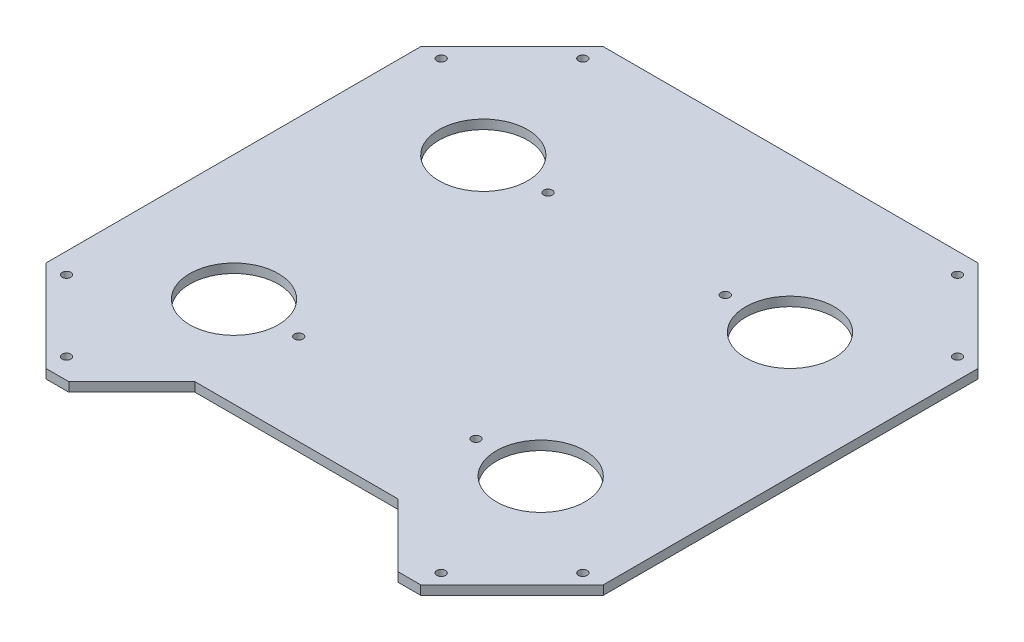
ISO-10303-21;
HEADER;
FILE_DESCRIPTION(('STEP AP214'),'2;1');
FILE_NAME('part.step','',(''),(''),'','','');
FILE_SCHEMA(('AUTOMOTIVE_DESIGN { 1 0 10303 214 1 1 1 1 }'));
ENDSEC;
DATA;
#1=APPLICATION_CONTEXT('core data for automotive mechanical design processes');
#2=APPLICATION_PROTOCOL_DEFINITION('international standard','automotive_design',2000,#1);
#3=PRODUCT_CONTEXT('',#1,'mechanical');
#4=PRODUCT('Part','Part','',(#3));
#5=PRODUCT_RELATED_PRODUCT_CATEGORY('part','',(#4));
#6=PRODUCT_DEFINITION_FORMATION('','',#4);
#7=PRODUCT_DEFINITION_CONTEXT('part definition',#1,'design');
#8=PRODUCT_DEFINITION('design','',#6,#7);
#9=PRODUCT_DEFINITION_SHAPE('','',#8);
#10=(LENGTH_UNIT() NAMED_UNIT(*) SI_UNIT(.MILLI.,.METRE.));
#11=(NAMED_UNIT(*) PLANE_ANGLE_UNIT() SI_UNIT($,.RADIAN.));
#12=(NAMED_UNIT(*) SI_UNIT($,.STERADIAN.) SOLID_ANGLE_UNIT());
#13=UNCERTAINTY_MEASURE_WITH_UNIT(LENGTH_MEASURE(1.E-05),#10,'distance_accuracy_value','');
#14=(GEOMETRIC_REPRESENTATION_CONTEXT(3) GLOBAL_UNCERTAINTY_ASSIGNED_CONTEXT((#13)) GLOBAL_UNIT_ASSIGNED_CONTEXT((#10,
#11,#12)) REPRESENTATION_CONTEXT('',''));
#15=CARTESIAN_POINT('',(0.,0.,0.));
#16=DIRECTION('',(0.,0.,1.));
#17=DIRECTION('',(1.,0.,0.));
#18=AXIS2_PLACEMENT_3D('',#15,#16,#17);
#19=CARTESIAN_POINT('',(0.,0.,0.));
#20=DIRECTION('',(0.,1.,0.));
#21=DIRECTION('',(0.,0.,1.));
#22=AXIS2_PLACEMENT_3D('',#19,#20,#21);
#23=PLANE('',#22);
#24=CARTESIAN_POINT('',(-204.999999999999,0.,-22.4577113704848));
#25=DIRECTION('',(0.,1.,0.));
#26=DIRECTION('',(0.,0.,1.));
#27=AXIS2_PLACEMENT_3D('',#24,#25,#26);
#28=CIRCLE('',#27,4.76250000000001);
#29=CARTESIAN_POINT('',(-204.999999999999,0.,-17.6952113704848));
#30=VERTEX_POINT('',#29);
#31=EDGE_CURVE('E417',#30,#30,#28,.T.);
#32=ORIENTED_EDGE('',*,*,#31,.T.);
#33=EDGE_LOOP('',(#32));
#34=FACE_BOUND('',#33,.T.);
#35=CARTESIAN_POINT('',(282.542288629515,0.,-509.999999999999));
#36=DIRECTION('',(0.,1.,0.));
#37=DIRECTION('',(0.,0.,1.));
#38=AXIS2_PLACEMENT_3D('',#35,#36,#37);
#39=CIRCLE('',#38,4.76250000000003);
#40=CARTESIAN_POINT('',(282.542288629515,0.,-505.237499999999));
#41=VERTEX_POINT('',#40);
#42=EDGE_CURVE('E426',#41,#41,#39,.T.);
#43=ORIENTED_EDGE('',*,*,#42,.T.);
#44=EDGE_LOOP('',(#43));
#45=FACE_BOUND('',#44,.T.);
#46=CARTESIAN_POINT('',(204.999999999999,0.,-587.542288629515));
#47=DIRECTION('',(0.,1.,0.));
#48=DIRECTION('',(0.,0.,1.));
#49=AXIS2_PLACEMENT_3D('',#46,#47,#48);
#50=CIRCLE('',#49,4.76250000000003);
#51=CARTESIAN_POINT('',(204.999999999999,0.,-582.779788629515));
#52=VERTEX_POINT('',#51);
#53=EDGE_CURVE('E429',#52,#52,#50,.T.);
#54=ORIENTED_EDGE('',*,*,#53,.T.);
#55=EDGE_LOOP('',(#54));
#56=FACE_BOUND('',#55,.T.);
#57=CARTESIAN_POINT('',(-282.542288629515,0.,-100.000000000001));
#58=DIRECTION('',(0.,1.,0.));
#59=DIRECTION('',(0.,0.,1.));
#60=AXIS2_PLACEMENT_3D('',#57,#58,#59);
#61=CIRCLE('',#60,4.76250000000001);
#62=CARTESIAN_POINT('',(-282.542288629515,0.,-95.237500000001));
#63=VERTEX_POINT('',#62);
#64=EDGE_CURVE('E438',#63,#63,#61,.T.);
#65=ORIENTED_EDGE('',*,*,#64,.T.);
#66=EDGE_LOOP('',(#65));
#67=FACE_BOUND('',#66,.T.);
#68=DIRECTION('',(1.,0.,0.));
#69=VECTOR('',#68,1.);
#70=CARTESIAN_POINT('',(0.,0.,0.));
#71=LINE('',#70,#69);
#72=CARTESIAN_POINT('',(180.,0.,0.));
#73=VERTEX_POINT('',#72);
#74=CARTESIAN_POINT('',(205.,0.,0.));
#75=VERTEX_POINT('',#74);
#76=EDGE_CURVE('E303',#73,#75,#71,.T.);
#77=ORIENTED_EDGE('',*,*,#76,.F.);
#78=DIRECTION('',(-0.707106781186551,0.,-0.707106781186544));
#79=VECTOR('',#78,1.);
#80=CARTESIAN_POINT('',(89.9999999999989,0.,-89.9999999999999));
#81=LINE('',#80,#79);
#82=CARTESIAN_POINT('',(110.999999999999,0.,-69.0000000000001));
#83=VERTEX_POINT('',#82);
#84=EDGE_CURVE('E295',#73,#83,#81,.T.);
#85=ORIENTED_EDGE('',*,*,#84,.T.);
#86=DIRECTION('',(-1.,0.,0.));
#87=VECTOR('',#86,1.);
#88=CARTESIAN_POINT('',(0.,0.,-69.0000000000001));
#89=LINE('',#88,#87);
#90=CARTESIAN_POINT('',(-111.,0.,-69.));
#91=VERTEX_POINT('',#90);
#92=EDGE_CURVE('E364',#83,#91,#89,.T.);
#93=ORIENTED_EDGE('',*,*,#92,.T.);
#94=DIRECTION('',(0.707106781186546,0.,-0.707106781186549));
#95=VECTOR('',#94,1.);
#96=CARTESIAN_POINT('',(-90.0000000000003,0.,-89.9999999999999));
#97=LINE('',#96,#95);
#98=CARTESIAN_POINT('',(-180.,0.,0.));
#99=VERTEX_POINT('',#98);
#100=EDGE_CURVE('E360',#99,#91,#97,.T.);
#101=ORIENTED_EDGE('',*,*,#100,.F.);
#102=CARTESIAN_POINT('',(-205.,0.,0.));
#103=VERTEX_POINT('',#102);
#104=EDGE_CURVE('E304',#103,#99,#71,.T.);
#105=ORIENTED_EDGE('',*,*,#104,.F.);
#106=DIRECTION('',(0.707106781186545,0.,0.707106781186551));
#107=VECTOR('',#106,1.);
#108=CARTESIAN_POINT('',(-102.500000000001,0.,102.5));
#109=LINE('',#108,#107);
#110=CARTESIAN_POINT('',(-305.,0.,-100.000000000001));
#111=VERTEX_POINT('',#110);
#112=EDGE_CURVE('E300',#111,#103,#109,.T.);
#113=ORIENTED_EDGE('',*,*,#112,.F.);
#114=DIRECTION('',(0.,0.,1.));
#115=VECTOR('',#114,1.);
#116=CARTESIAN_POINT('',(-305.,0.,0.));
#117=LINE('',#116,#115);
#118=CARTESIAN_POINT('',(-305.,0.,-509.999999999999));
#119=VERTEX_POINT('',#118);
#120=EDGE_CURVE('E298',#119,#111,#117,.T.);
#121=ORIENTED_EDGE('',*,*,#120,.F.);
#122=DIRECTION('',(0.707106781186542,0.,-0.707106781186553));
#123=VECTOR('',#122,1.);
#124=CARTESIAN_POINT('',(-407.500000000002,0.,-407.499999999996));
#125=LINE('',#124,#123);
#126=CARTESIAN_POINT('',(-205.,0.,-610.));
#127=VERTEX_POINT('',#126);
#128=EDGE_CURVE('E315',#119,#127,#125,.T.);
#129=ORIENTED_EDGE('',*,*,#128,.T.);
#130=DIRECTION('',(-1.,0.,0.));
#131=VECTOR('',#130,1.);
#132=CARTESIAN_POINT('',(0.,0.,-610.));
#133=LINE('',#132,#131);
#134=CARTESIAN_POINT('',(205.,0.,-610.));
#135=VERTEX_POINT('',#134);
#136=EDGE_CURVE('E313',#135,#127,#133,.T.);
#137=ORIENTED_EDGE('',*,*,#136,.F.);
#138=DIRECTION('',(-0.707106781186544,0.,-0.707106781186551));
#139=VECTOR('',#138,1.);
#140=CARTESIAN_POINT('',(407.500000000001,0.,-407.499999999997));
#141=LINE('',#140,#139);
#142=CARTESIAN_POINT('',(305.,0.,-509.999999999999));
#143=VERTEX_POINT('',#142);
#144=EDGE_CURVE('E260',#143,#135,#141,.T.);
#145=ORIENTED_EDGE('',*,*,#144,.F.);
#146=DIRECTION('',(0.,0.,-1.));
#147=VECTOR('',#146,1.);
#148=CARTESIAN_POINT('',(305.,0.,0.));
#149=LINE('',#148,#147);
#150=CARTESIAN_POINT('',(305.,0.,-100.000000000001));
#151=VERTEX_POINT('',#150);
#152=EDGE_CURVE('E310',#151,#143,#149,.T.);
#153=ORIENTED_EDGE('',*,*,#152,.F.);
#154=DIRECTION('',(-0.707106781186545,0.,0.707106781186551));
#155=VECTOR('',#154,1.);
#156=CARTESIAN_POINT('',(102.500000000001,0.,102.5));
#157=LINE('',#156,#155);
#158=EDGE_CURVE('E307',#151,#75,#157,.T.);
#159=ORIENTED_EDGE('',*,*,#158,.T.);
#160=EDGE_LOOP('',(#77,#85,#93,#101,#105,#113,#121,#129,#137,#145,#153,#159));
#161=FACE_BOUND('',#160,.T.);
#162=CARTESIAN_POINT('',(-167.821284449809,0.,-168.589357775095));
#163=DIRECTION('',(0.,1.,0.));
#164=DIRECTION('',(0.,0.,1.));
#165=AXIS2_PLACEMENT_3D('',#162,#163,#164);
#166=CIRCLE('',#165,48.5);
#167=CARTESIAN_POINT('',(-167.821284449809,0.,-120.089357775095));
#168=VERTEX_POINT('',#167);
#169=EDGE_CURVE('E318',#168,#168,#166,.F.);
#170=ORIENTED_EDGE('',*,*,#169,.F.);
#171=EDGE_LOOP('',(#170));
#172=FACE_BOUND('',#171,.T.);
#173=CARTESIAN_POINT('',(-167.821284449809,0.,-441.410642224905));
#174=DIRECTION('',(0.,1.,0.));
#175=DIRECTION('',(0.,0.,1.));
#176=AXIS2_PLACEMENT_3D('',#173,#174,#175);
#177=CIRCLE('',#176,48.4999999999998);
#178=CARTESIAN_POINT('',(-167.821284449809,0.,-392.910642224905));
#179=VERTEX_POINT('',#178);
#180=EDGE_CURVE('E321',#179,#179,#177,.T.);
#181=ORIENTED_EDGE('',*,*,#180,.T.);
#182=EDGE_LOOP('',(#181));
#183=FACE_BOUND('',#182,.T.);
#184=CARTESIAN_POINT('',(-97.,0.,-441.410642224905));
#185=DIRECTION('',(0.,1.,0.));
#186=DIRECTION('',(0.,0.,1.));
#187=AXIS2_PLACEMENT_3D('',#184,#185,#186);
#188=CIRCLE('',#187,4.7625);
#189=CARTESIAN_POINT('',(-97.,0.,-436.648142224905));
#190=VERTEX_POINT('',#189);
#191=EDGE_CURVE('E324',#190,#190,#188,.T.);
#192=ORIENTED_EDGE('',*,*,#191,.T.);
#193=EDGE_LOOP('',(#192));
#194=FACE_BOUND('',#193,.T.);
#195=CARTESIAN_POINT('',(-96.9999999999998,0.,-168.589357775095));
#196=DIRECTION('',(0.,1.,0.));
#197=DIRECTION('',(0.,0.,1.));
#198=AXIS2_PLACEMENT_3D('',#195,#196,#197);
#199=CIRCLE('',#198,4.7625);
#200=CARTESIAN_POINT('',(-96.9999999999998,0.,-163.826857775095));
#201=VERTEX_POINT('',#200);
#202=EDGE_CURVE('E327',#201,#201,#199,.F.);
#203=ORIENTED_EDGE('',*,*,#202,.F.);
#204=EDGE_LOOP('',(#203));
#205=FACE_BOUND('',#204,.T.);
#206=CARTESIAN_POINT('',(97.,0.,-441.410642224905));
#207=DIRECTION('',(0.,1.,0.));
#208=DIRECTION('',(0.,0.,1.));
#209=AXIS2_PLACEMENT_3D('',#206,#207,#208);
#210=CIRCLE('',#209,4.7625);
#211=CARTESIAN_POINT('',(97.,0.,-436.648142224905));
#212=VERTEX_POINT('',#211);
#213=EDGE_CURVE('E333',#212,#212,#210,.F.);
#214=ORIENTED_EDGE('',*,*,#213,.F.);
#215=EDGE_LOOP('',(#214));
#216=FACE_BOUND('',#215,.T.);
#217=CARTESIAN_POINT('',(97.0000000000002,0.,-168.589357775095));
#218=DIRECTION('',(0.,1.,0.));
#219=DIRECTION('',(0.,0.,1.));
#220=AXIS2_PLACEMENT_3D('',#217,#218,#219);
#221=CIRCLE('',#220,4.7625);
#222=CARTESIAN_POINT('',(97.0000000000002,0.,-163.826857775095));
#223=VERTEX_POINT('',#222);
#224=EDGE_CURVE('E330',#223,#223,#221,.T.);
#225=ORIENTED_EDGE('',*,*,#224,.T.);
#226=EDGE_LOOP('',(#225));
#227=FACE_BOUND('',#226,.T.);
#228=CARTESIAN_POINT('',(167.821284449809,0.,-168.589357775095));
#229=DIRECTION('',(0.,1.,0.));
#230=DIRECTION('',(0.,0.,1.));
#231=AXIS2_PLACEMENT_3D('',#228,#229,#230);
#232=CIRCLE('',#231,48.5);
#233=CARTESIAN_POINT('',(167.821284449809,0.,-120.089357775095));
#234=VERTEX_POINT('',#233);
#235=EDGE_CURVE('E294',#234,#234,#232,.T.);
#236=ORIENTED_EDGE('',*,*,#235,.T.);
#237=EDGE_LOOP('',(#236));
#238=FACE_BOUND('',#237,.T.);
#239=CARTESIAN_POINT('',(167.82128444981,0.,-441.410642224905));
#240=DIRECTION('',(0.,1.,0.));
#241=DIRECTION('',(0.,0.,1.));
#242=AXIS2_PLACEMENT_3D('',#239,#240,#241);
#243=CIRCLE('',#242,48.5);
#244=CARTESIAN_POINT('',(167.82128444981,0.,-392.910642224905));
#245=VERTEX_POINT('',#244);
#246=EDGE_CURVE('E291',#245,#245,#243,.F.);
#247=ORIENTED_EDGE('',*,*,#246,.F.);
#248=EDGE_LOOP('',(#247));
#249=FACE_BOUND('',#248,.T.);
#250=CARTESIAN_POINT('',(-282.542288629515,0.,-509.999999999999));
#251=DIRECTION('',(0.,1.,0.));
#252=DIRECTION('',(0.,0.,1.));
#253=AXIS2_PLACEMENT_3D('',#250,#251,#252);
#254=CIRCLE('',#253,4.76250000000003);
#255=CARTESIAN_POINT('',(-282.542288629515,0.,-505.237499999999));
#256=VERTEX_POINT('',#255);
#257=EDGE_CURVE('E435',#256,#256,#254,.F.);
#258=ORIENTED_EDGE('',*,*,#257,.F.);
#259=EDGE_LOOP('',(#258));
#260=FACE_BOUND('',#259,.T.);
#261=CARTESIAN_POINT('',(-204.999999999999,0.,-587.542288629515));
#262=DIRECTION('',(0.,1.,0.));
#263=DIRECTION('',(0.,0.,1.));
#264=AXIS2_PLACEMENT_3D('',#261,#262,#263);
#265=CIRCLE('',#264,4.76250000000003);
#266=CARTESIAN_POINT('',(-204.999999999999,0.,-582.779788629515));
#267=VERTEX_POINT('',#266);
#268=EDGE_CURVE('E432',#267,#267,#265,.F.);
#269=ORIENTED_EDGE('',*,*,#268,.F.);
#270=EDGE_LOOP('',(#269));
#271=FACE_BOUND('',#270,.T.);
#272=CARTESIAN_POINT('',(282.542288629515,0.,-100.000000000001));
#273=DIRECTION('',(0.,1.,0.));
#274=DIRECTION('',(0.,0.,1.));
#275=AXIS2_PLACEMENT_3D('',#272,#273,#274);
#276=CIRCLE('',#275,4.76250000000001);
#277=CARTESIAN_POINT('',(282.542288629515,0.,-95.237500000001));
#278=VERTEX_POINT('',#277);
#279=EDGE_CURVE('E423',#278,#278,#276,.F.);
#280=ORIENTED_EDGE('',*,*,#279,.F.);
#281=EDGE_LOOP('',(#280));
#282=FACE_BOUND('',#281,.T.);
#283=CARTESIAN_POINT('',(204.999999999999,0.,-22.4577113704848));
#284=DIRECTION('',(0.,1.,0.));
#285=DIRECTION('',(0.,0.,1.));
#286=AXIS2_PLACEMENT_3D('',#283,#284,#285);
#287=CIRCLE('',#286,4.76250000000001);
#288=CARTESIAN_POINT('',(204.999999999999,0.,-17.6952113704848));
#289=VERTEX_POINT('',#288);
#290=EDGE_CURVE('E420',#289,#289,#287,.F.);
#291=ORIENTED_EDGE('',*,*,#290,.F.);
#292=EDGE_LOOP('',(#291));
#293=FACE_BOUND('',#292,.T.);
#294=ADVANCED_FACE('F161',(#34,#45,#56,#67,#161,#172,#183,#194,#205,#216,#227,#238,#249,#260,
#271,#282,#293),#23,.F.);
#295=CARTESIAN_POINT('',(0.,10.,0.));
#296=DIRECTION('',(0.,1.,0.));
#297=DIRECTION('',(0.,0.,1.));
#298=AXIS2_PLACEMENT_3D('',#295,#296,#297);
#299=PLANE('',#298);
#300=CARTESIAN_POINT('',(-204.999999999999,10.,-22.4577113704848));
#301=DIRECTION('',(0.,1.,0.));
#302=DIRECTION('',(0.,0.,1.));
#303=AXIS2_PLACEMENT_3D('',#300,#301,#302);
#304=CIRCLE('',#303,4.76250000000001);
#305=CARTESIAN_POINT('',(-204.999999999999,10.,-17.6952113704848));
#306=VERTEX_POINT('',#305);
#307=EDGE_CURVE('E444',#306,#306,#304,.T.);
#308=ORIENTED_EDGE('',*,*,#307,.F.);
#309=EDGE_LOOP('',(#308));
#310=FACE_BOUND('',#309,.T.);
#311=CARTESIAN_POINT('',(282.542288629515,10.,-100.000000000001));
#312=DIRECTION('',(0.,-1.,0.));
#313=DIRECTION('',(0.,0.,-1.));
#314=AXIS2_PLACEMENT_3D('',#311,#312,#313);
#315=CIRCLE('',#314,4.76250000000001);
#316=CARTESIAN_POINT('',(282.542288629515,10.,-104.762500000001));
#317=VERTEX_POINT('',#316);
#318=EDGE_CURVE('E448',#317,#317,#315,.T.);
#319=ORIENTED_EDGE('',*,*,#318,.T.);
#320=EDGE_LOOP('',(#319));
#321=FACE_BOUND('',#320,.T.);
#322=CARTESIAN_POINT('',(282.542288629515,10.,-509.999999999999));
#323=DIRECTION('',(0.,1.,0.));
#324=DIRECTION('',(0.,0.,1.));
#325=AXIS2_PLACEMENT_3D('',#322,#323,#324);
#326=CIRCLE('',#325,4.76250000000003);
#327=CARTESIAN_POINT('',(282.542288629515,10.,-505.237499999999));
#328=VERTEX_POINT('',#327);
#329=EDGE_CURVE('E445',#328,#328,#326,.T.);
#330=ORIENTED_EDGE('',*,*,#329,.F.);
#331=EDGE_LOOP('',(#330));
#332=FACE_BOUND('',#331,.T.);
#333=CARTESIAN_POINT('',(204.999999999999,10.,-587.542288629515));
#334=DIRECTION('',(0.,1.,0.));
#335=DIRECTION('',(0.,0.,1.));
#336=AXIS2_PLACEMENT_3D('',#333,#334,#335);
#337=CIRCLE('',#336,4.76250000000003);
#338=CARTESIAN_POINT('',(204.999999999999,10.,-582.779788629515));
#339=VERTEX_POINT('',#338);
#340=EDGE_CURVE('E449',#339,#339,#337,.T.);
#341=ORIENTED_EDGE('',*,*,#340,.F.);
#342=EDGE_LOOP('',(#341));
#343=FACE_BOUND('',#342,.T.);
#344=CARTESIAN_POINT('',(-282.542288629515,10.,-509.999999999999));
#345=DIRECTION('',(0.,-1.,0.));
#346=DIRECTION('',(0.,0.,-1.));
#347=AXIS2_PLACEMENT_3D('',#344,#345,#346);
#348=CIRCLE('',#347,4.76250000000003);
#349=CARTESIAN_POINT('',(-282.542288629515,10.,-514.762499999999));
#350=VERTEX_POINT('',#349);
#351=EDGE_CURVE('E457',#350,#350,#348,.T.);
#352=ORIENTED_EDGE('',*,*,#351,.T.);
#353=EDGE_LOOP('',(#352));
#354=FACE_BOUND('',#353,.T.);
#355=CARTESIAN_POINT('',(-282.542288629515,10.,-100.000000000001));
#356=DIRECTION('',(0.,1.,0.));
#357=DIRECTION('',(0.,0.,1.));
#358=AXIS2_PLACEMENT_3D('',#355,#356,#357);
#359=CIRCLE('',#358,4.76250000000001);
#360=CARTESIAN_POINT('',(-282.542288629515,10.,-95.237500000001));
#361=VERTEX_POINT('',#360);
#362=EDGE_CURVE('E441',#361,#361,#359,.T.);
#363=ORIENTED_EDGE('',*,*,#362,.F.);
#364=EDGE_LOOP('',(#363));
#365=FACE_BOUND('',#364,.T.);
#366=DIRECTION('',(-0.707106781186551,0.,-0.707106781186544));
#367=VECTOR('',#366,1.);
#368=CARTESIAN_POINT('',(89.9999999999989,10.,-89.9999999999999));
#369=LINE('',#368,#367);
#370=CARTESIAN_POINT('',(180.,10.,0.));
#371=VERTEX_POINT('',#370);
#372=CARTESIAN_POINT('',(110.999999999999,10.,-69.0000000000001));
#373=VERTEX_POINT('',#372);
#374=EDGE_CURVE('E176',#371,#373,#369,.T.);
#375=ORIENTED_EDGE('',*,*,#374,.F.);
#376=DIRECTION('',(1.,0.,0.));
#377=VECTOR('',#376,1.);
#378=CARTESIAN_POINT('',(0.,10.,0.));
#379=LINE('',#378,#377);
#380=CARTESIAN_POINT('',(205.,10.,0.));
#381=VERTEX_POINT('',#380);
#382=EDGE_CURVE('E383',#371,#381,#379,.T.);
#383=ORIENTED_EDGE('',*,*,#382,.T.);
#384=DIRECTION('',(-0.707106781186545,0.,0.707106781186551));
#385=VECTOR('',#384,1.);
#386=CARTESIAN_POINT('',(102.500000000001,10.,102.5));
#387=LINE('',#386,#385);
#388=CARTESIAN_POINT('',(305.,10.,-100.000000000001));
#389=VERTEX_POINT('',#388);
#390=EDGE_CURVE('E385',#389,#381,#387,.T.);
#391=ORIENTED_EDGE('',*,*,#390,.F.);
#392=DIRECTION('',(0.,0.,-1.));
#393=VECTOR('',#392,1.);
#394=CARTESIAN_POINT('',(305.,10.,0.));
#395=LINE('',#394,#393);
#396=CARTESIAN_POINT('',(305.,10.,-509.999999999999));
#397=VERTEX_POINT('',#396);
#398=EDGE_CURVE('E251',#389,#397,#395,.T.);
#399=ORIENTED_EDGE('',*,*,#398,.T.);
#400=DIRECTION('',(-0.707106781186544,0.,-0.707106781186551));
#401=VECTOR('',#400,1.);
#402=CARTESIAN_POINT('',(407.500000000001,10.,-407.499999999997));
#403=LINE('',#402,#401);
#404=CARTESIAN_POINT('',(205.,10.,-610.));
#405=VERTEX_POINT('',#404);
#406=EDGE_CURVE('E241',#397,#405,#403,.T.);
#407=ORIENTED_EDGE('',*,*,#406,.T.);
#408=DIRECTION('',(-1.,0.,0.));
#409=VECTOR('',#408,1.);
#410=CARTESIAN_POINT('',(0.,10.,-610.));
#411=LINE('',#410,#409);
#412=CARTESIAN_POINT('',(-205.,10.,-610.));
#413=VERTEX_POINT('',#412);
#414=EDGE_CURVE('E247',#405,#413,#411,.T.);
#415=ORIENTED_EDGE('',*,*,#414,.T.);
#416=DIRECTION('',(0.707106781186542,0.,-0.707106781186553));
#417=VECTOR('',#416,1.);
#418=CARTESIAN_POINT('',(-407.500000000002,10.,-407.499999999996));
#419=LINE('',#418,#417);
#420=CARTESIAN_POINT('',(-305.,10.,-509.999999999999));
#421=VERTEX_POINT('',#420);
#422=EDGE_CURVE('E268',#421,#413,#419,.T.);
#423=ORIENTED_EDGE('',*,*,#422,.F.);
#424=DIRECTION('',(0.,0.,1.));
#425=VECTOR('',#424,1.);
#426=CARTESIAN_POINT('',(-305.,10.,0.));
#427=LINE('',#426,#425);
#428=CARTESIAN_POINT('',(-305.,10.,-100.000000000001));
#429=VERTEX_POINT('',#428);
#430=EDGE_CURVE('E380',#421,#429,#427,.T.);
#431=ORIENTED_EDGE('',*,*,#430,.T.);
#432=DIRECTION('',(0.707106781186545,0.,0.707106781186551));
#433=VECTOR('',#432,1.);
#434=CARTESIAN_POINT('',(-102.500000000001,10.,102.5));
#435=LINE('',#434,#433);
#436=CARTESIAN_POINT('',(-205.,10.,0.));
#437=VERTEX_POINT('',#436);
#438=EDGE_CURVE('E224',#429,#437,#435,.T.);
#439=ORIENTED_EDGE('',*,*,#438,.T.);
#440=CARTESIAN_POINT('',(-180.,10.,0.));
#441=VERTEX_POINT('',#440);
#442=EDGE_CURVE('E351',#437,#441,#379,.T.);
#443=ORIENTED_EDGE('',*,*,#442,.T.);
#444=DIRECTION('',(0.707106781186546,0.,-0.707106781186549));
#445=VECTOR('',#444,1.);
#446=CARTESIAN_POINT('',(-90.0000000000003,10.,-89.9999999999999));
#447=LINE('',#446,#445);
#448=CARTESIAN_POINT('',(-111.,10.,-69.));
#449=VERTEX_POINT('',#448);
#450=EDGE_CURVE('E406',#441,#449,#447,.T.);
#451=ORIENTED_EDGE('',*,*,#450,.T.);
#452=DIRECTION('',(-1.,0.,0.));
#453=VECTOR('',#452,1.);
#454=CARTESIAN_POINT('',(0.,10.,-69.0000000000001));
#455=LINE('',#454,#453);
#456=EDGE_CURVE('E410',#373,#449,#455,.T.);
#457=ORIENTED_EDGE('',*,*,#456,.F.);
#458=EDGE_LOOP('',(#375,#383,#391,#399,#407,#415,#423,#431,#439,#443,#451,#457));
#459=FACE_BOUND('',#458,.T.);
#460=CARTESIAN_POINT('',(-167.821284449809,10.,-168.589357775095));
#461=DIRECTION('',(0.,1.,0.));
#462=DIRECTION('',(0.,0.,1.));
#463=AXIS2_PLACEMENT_3D('',#460,#461,#462);
#464=CIRCLE('',#463,48.5);
#465=CARTESIAN_POINT('',(-167.821284449809,10.,-120.089357775095));
#466=VERTEX_POINT('',#465);
#467=EDGE_CURVE('E270',#466,#466,#464,.F.);
#468=ORIENTED_EDGE('',*,*,#467,.T.);
#469=EDGE_LOOP('',(#468));
#470=FACE_BOUND('',#469,.T.);
#471=CARTESIAN_POINT('',(-167.821284449809,10.,-441.410642224905));
#472=DIRECTION('',(0.,1.,0.));
#473=DIRECTION('',(0.,0.,1.));
#474=AXIS2_PLACEMENT_3D('',#471,#472,#473);
#475=CIRCLE('',#474,48.4999999999998);
#476=CARTESIAN_POINT('',(-167.821284449809,10.,-392.910642224905));
#477=VERTEX_POINT('',#476);
#478=EDGE_CURVE('E276',#477,#477,#475,.T.);
#479=ORIENTED_EDGE('',*,*,#478,.F.);
#480=EDGE_LOOP('',(#479));
#481=FACE_BOUND('',#480,.T.);
#482=CARTESIAN_POINT('',(-97.,10.,-441.410642224905));
#483=DIRECTION('',(0.,1.,0.));
#484=DIRECTION('',(0.,0.,1.));
#485=AXIS2_PLACEMENT_3D('',#482,#483,#484);
#486=CIRCLE('',#485,4.7625);
#487=CARTESIAN_POINT('',(-97.,10.,-436.648142224905));
#488=VERTEX_POINT('',#487);
#489=EDGE_CURVE('E279',#488,#488,#486,.T.);
#490=ORIENTED_EDGE('',*,*,#489,.F.);
#491=EDGE_LOOP('',(#490));
#492=FACE_BOUND('',#491,.T.);
#493=CARTESIAN_POINT('',(-96.9999999999998,10.,-168.589357775095));
#494=DIRECTION('',(0.,1.,0.));
#495=DIRECTION('',(0.,0.,1.));
#496=AXIS2_PLACEMENT_3D('',#493,#494,#495);
#497=CIRCLE('',#496,4.7625);
#498=CARTESIAN_POINT('',(-96.9999999999998,10.,-163.826857775095));
#499=VERTEX_POINT('',#498);
#500=EDGE_CURVE('E282',#499,#499,#497,.F.);
#501=ORIENTED_EDGE('',*,*,#500,.T.);
#502=EDGE_LOOP('',(#501));
#503=FACE_BOUND('',#502,.T.);
#504=CARTESIAN_POINT('',(97.,10.,-441.410642224905));
#505=DIRECTION('',(0.,1.,0.));
#506=DIRECTION('',(0.,0.,1.));
#507=AXIS2_PLACEMENT_3D('',#504,#505,#506);
#508=CIRCLE('',#507,4.7625);
#509=CARTESIAN_POINT('',(97.,10.,-436.648142224905));
#510=VERTEX_POINT('',#509);
#511=EDGE_CURVE('E288',#510,#510,#508,.F.);
#512=ORIENTED_EDGE('',*,*,#511,.T.);
#513=EDGE_LOOP('',(#512));
#514=FACE_BOUND('',#513,.T.);
#515=CARTESIAN_POINT('',(97.0000000000002,10.,-168.589357775095));
#516=DIRECTION('',(0.,1.,0.));
#517=DIRECTION('',(0.,0.,1.));
#518=AXIS2_PLACEMENT_3D('',#515,#516,#517);
#519=CIRCLE('',#518,4.7625);
#520=CARTESIAN_POINT('',(97.0000000000002,10.,-163.826857775095));
#521=VERTEX_POINT('',#520);
#522=EDGE_CURVE('E285',#521,#521,#519,.T.);
#523=ORIENTED_EDGE('',*,*,#522,.F.);
#524=EDGE_LOOP('',(#523));
#525=FACE_BOUND('',#524,.T.);
#526=CARTESIAN_POINT('',(167.821284449809,10.,-168.589357775095));
#527=DIRECTION('',(0.,1.,0.));
#528=DIRECTION('',(0.,0.,1.));
#529=AXIS2_PLACEMENT_3D('',#526,#527,#528);
#530=CIRCLE('',#529,48.5);
#531=CARTESIAN_POINT('',(167.821284449809,10.,-120.089357775095));
#532=VERTEX_POINT('',#531);
#533=EDGE_CURVE('E377',#532,#532,#530,.T.);
#534=ORIENTED_EDGE('',*,*,#533,.F.);
#535=EDGE_LOOP('',(#534));
#536=FACE_BOUND('',#535,.T.);
#537=CARTESIAN_POINT('',(167.82128444981,10.,-441.410642224905));
#538=DIRECTION('',(0.,1.,0.));
#539=DIRECTION('',(0.,0.,1.));
#540=AXIS2_PLACEMENT_3D('',#537,#538,#539);
#541=CIRCLE('',#540,48.5);
#542=CARTESIAN_POINT('',(167.82128444981,10.,-392.910642224905));
#543=VERTEX_POINT('',#542);
#544=EDGE_CURVE('E336',#543,#543,#541,.F.);
#545=ORIENTED_EDGE('',*,*,#544,.T.);
#546=EDGE_LOOP('',(#545));
#547=FACE_BOUND('',#546,.T.);
#548=CARTESIAN_POINT('',(-204.999999999999,10.,-587.542288629515));
#549=DIRECTION('',(0.,-1.,0.));
#550=DIRECTION('',(0.,0.,-1.));
#551=AXIS2_PLACEMENT_3D('',#548,#549,#550);
#552=CIRCLE('',#551,4.76250000000003);
#553=CARTESIAN_POINT('',(-204.999999999999,10.,-592.304788629515));
#554=VERTEX_POINT('',#553);
#555=EDGE_CURVE('E460',#554,#554,#552,.T.);
#556=ORIENTED_EDGE('',*,*,#555,.T.);
#557=EDGE_LOOP('',(#556));
#558=FACE_BOUND('',#557,.T.);
#559=CARTESIAN_POINT('',(204.999999999999,10.,-22.4577113704848));
#560=DIRECTION('',(0.,-1.,0.));
#561=DIRECTION('',(0.,0.,-1.));
#562=AXIS2_PLACEMENT_3D('',#559,#560,#561);
#563=CIRCLE('',#562,4.76250000000001);
#564=CARTESIAN_POINT('',(204.999999999999,10.,-27.2202113704848));
#565=VERTEX_POINT('',#564);
#566=EDGE_CURVE('E452',#565,#565,#563,.T.);
#567=ORIENTED_EDGE('',*,*,#566,.T.);
#568=EDGE_LOOP('',(#567));
#569=FACE_BOUND('',#568,.T.);
#570=ADVANCED_FACE('F243',(#310,#321,#332,#343,#354,#365,#459,#470,#481,#492,#503,#514,#525,
#536,#547,#558,#569),#299,.T.);
#571=CARTESIAN_POINT('',(0.,10.,0.));
#572=DIRECTION('',(0.,0.,-1.));
#573=DIRECTION('',(-1.,0.,0.));
#574=AXIS2_PLACEMENT_3D('',#571,#572,#573);
#575=PLANE('',#574);
#576=DIRECTION('',(0.,1.,0.));
#577=VECTOR('',#576,1.);
#578=CARTESIAN_POINT('',(-180.,-4990.,0.));
#579=LINE('',#578,#577);
#580=EDGE_CURVE('E407',#99,#441,#579,.T.);
#581=ORIENTED_EDGE('',*,*,#580,.T.);
#582=ORIENTED_EDGE('',*,*,#442,.F.);
#583=DIRECTION('',(0.,-1.,0.));
#584=VECTOR('',#583,1.);
#585=CARTESIAN_POINT('',(-205.,10.,0.));
#586=LINE('',#585,#584);
#587=EDGE_CURVE('E169',#437,#103,#586,.T.);
#588=ORIENTED_EDGE('',*,*,#587,.T.);
#589=ORIENTED_EDGE('',*,*,#104,.T.);
#590=EDGE_LOOP('',(#581,#582,#588,#589));
#591=FACE_BOUND('',#590,.T.);
#592=ADVANCED_FACE('F348',(#591),#575,.F.);
#593=CARTESIAN_POINT('',(0.,10.,-610.));
#594=DIRECTION('',(0.,0.,1.));
#595=DIRECTION('',(1.,0.,0.));
#596=AXIS2_PLACEMENT_3D('',#593,#594,#595);
#597=PLANE('',#596);
#598=DIRECTION('',(0.,-1.,0.));
#599=VECTOR('',#598,1.);
#600=CARTESIAN_POINT('',(-205.,10.,-610.));
#601=LINE('',#600,#599);
#602=EDGE_CURVE('E264',#413,#127,#601,.T.);
#603=ORIENTED_EDGE('',*,*,#602,.F.);
#604=ORIENTED_EDGE('',*,*,#414,.F.);
#605=DIRECTION('',(0.,-1.,0.));
#606=VECTOR('',#605,1.);
#607=CARTESIAN_POINT('',(205.,10.,-610.));
#608=LINE('',#607,#606);
#609=EDGE_CURVE('E257',#405,#135,#608,.T.);
#610=ORIENTED_EDGE('',*,*,#609,.T.);
#611=ORIENTED_EDGE('',*,*,#136,.T.);
#612=EDGE_LOOP('',(#603,#604,#610,#611));
#613=FACE_BOUND('',#612,.T.);
#614=ADVANCED_FACE('F266',(#613),#597,.F.);
#615=ORIENTED_EDGE('',*,*,#382,.F.);
#616=DIRECTION('',(0.,1.,0.));
#617=VECTOR('',#616,1.);
#618=CARTESIAN_POINT('',(180.,-4990.,0.));
#619=LINE('',#618,#617);
#620=EDGE_CURVE('E371',#73,#371,#619,.T.);
#621=ORIENTED_EDGE('',*,*,#620,.F.);
#622=ORIENTED_EDGE('',*,*,#76,.T.);
#623=DIRECTION('',(0.,-1.,0.));
#624=VECTOR('',#623,1.);
#625=CARTESIAN_POINT('',(205.,10.,0.));
#626=LINE('',#625,#624);
#627=EDGE_CURVE('E342',#381,#75,#626,.T.);
#628=ORIENTED_EDGE('',*,*,#627,.F.);
#629=EDGE_LOOP('',(#615,#621,#622,#628));
#630=FACE_BOUND('',#629,.T.);
#631=ADVANCED_FACE('F396',(#630),#575,.F.);
#632=CARTESIAN_POINT('',(102.500000000001,10.,102.5));
#633=DIRECTION('',(0.707106781186551,0.,0.707106781186545));
#634=DIRECTION('',(0.707106781186545,0.,-0.707106781186551));
#635=AXIS2_PLACEMENT_3D('',#632,#633,#634);
#636=PLANE('',#635);
#637=ORIENTED_EDGE('',*,*,#158,.F.);
#638=DIRECTION('',(0.,-1.,0.));
#639=VECTOR('',#638,1.);
#640=CARTESIAN_POINT('',(305.,10.,-100.000000000001));
#641=LINE('',#640,#639);
#642=EDGE_CURVE('E340',#389,#151,#641,.T.);
#643=ORIENTED_EDGE('',*,*,#642,.F.);
#644=ORIENTED_EDGE('',*,*,#390,.T.);
#645=ORIENTED_EDGE('',*,*,#627,.T.);
#646=EDGE_LOOP('',(#637,#643,#644,#645));
#647=FACE_BOUND('',#646,.T.);
#648=ADVANCED_FACE('F389',(#647),#636,.T.);
#649=CARTESIAN_POINT('',(305.,10.,0.));
#650=DIRECTION('',(-1.,0.,0.));
#651=DIRECTION('',(0.,0.,1.));
#652=AXIS2_PLACEMENT_3D('',#649,#650,#651);
#653=PLANE('',#652);
#654=ORIENTED_EDGE('',*,*,#152,.T.);
#655=DIRECTION('',(0.,-1.,0.));
#656=VECTOR('',#655,1.);
#657=CARTESIAN_POINT('',(305.,10.,-509.999999999999));
#658=LINE('',#657,#656);
#659=EDGE_CURVE('E263',#397,#143,#658,.T.);
#660=ORIENTED_EDGE('',*,*,#659,.F.);
#661=ORIENTED_EDGE('',*,*,#398,.F.);
#662=ORIENTED_EDGE('',*,*,#642,.T.);
#663=EDGE_LOOP('',(#654,#660,#661,#662));
#664=FACE_BOUND('',#663,.T.);
#665=ADVANCED_FACE('F527',(#664),#653,.F.);
#666=CARTESIAN_POINT('',(407.500000000001,10.,-407.499999999997));
#667=DIRECTION('',(-0.707106781186551,0.,0.707106781186544));
#668=DIRECTION('',(0.707106781186544,0.,0.707106781186551));
#669=AXIS2_PLACEMENT_3D('',#666,#667,#668);
#670=PLANE('',#669);
#671=ORIENTED_EDGE('',*,*,#144,.T.);
#672=ORIENTED_EDGE('',*,*,#609,.F.);
#673=ORIENTED_EDGE('',*,*,#406,.F.);
#674=ORIENTED_EDGE('',*,*,#659,.T.);
#675=EDGE_LOOP('',(#671,#672,#673,#674));
#676=FACE_BOUND('',#675,.T.);
#677=ADVANCED_FACE('F258',(#676),#670,.F.);
#678=CARTESIAN_POINT('',(167.82128444981,10.,-441.410642224905));
#679=DIRECTION('',(0.,-1.,0.));
#680=DIRECTION('',(0.,0.,-1.));
#681=AXIS2_PLACEMENT_3D('',#678,#679,#680);
#682=CYLINDRICAL_SURFACE('',#681,48.5);
#683=ORIENTED_EDGE('',*,*,#544,.F.);
#684=EDGE_LOOP('',(#683));
#685=FACE_BOUND('',#684,.T.);
#686=ORIENTED_EDGE('',*,*,#246,.T.);
#687=EDGE_LOOP('',(#686));
#688=FACE_BOUND('',#687,.T.);
#689=ADVANCED_FACE('F163',(#685,#688),#682,.F.);
#690=CARTESIAN_POINT('',(167.821284449809,10.,-168.589357775095));
#691=DIRECTION('',(0.,-1.,0.));
#692=DIRECTION('',(0.,0.,-1.));
#693=AXIS2_PLACEMENT_3D('',#690,#691,#692);
#694=CYLINDRICAL_SURFACE('',#693,48.5);
#695=ORIENTED_EDGE('',*,*,#533,.T.);
#696=EDGE_LOOP('',(#695));
#697=FACE_BOUND('',#696,.T.);
#698=ORIENTED_EDGE('',*,*,#235,.F.);
#699=EDGE_LOOP('',(#698));
#700=FACE_BOUND('',#699,.T.);
#701=ADVANCED_FACE('F502',(#697,#700),#694,.F.);
#702=CARTESIAN_POINT('',(97.0000000000002,10.,-168.589357775095));
#703=DIRECTION('',(0.,-1.,0.));
#704=DIRECTION('',(0.,0.,-1.));
#705=AXIS2_PLACEMENT_3D('',#702,#703,#704);
#706=CYLINDRICAL_SURFACE('',#705,4.7625);
#707=ORIENTED_EDGE('',*,*,#522,.T.);
#708=EDGE_LOOP('',(#707));
#709=FACE_BOUND('',#708,.T.);
#710=ORIENTED_EDGE('',*,*,#224,.F.);
#711=EDGE_LOOP('',(#710));
#712=FACE_BOUND('',#711,.T.);
#713=ADVANCED_FACE('F498',(#709,#712),#706,.F.);
#714=CARTESIAN_POINT('',(97.,10.,-441.410642224905));
#715=DIRECTION('',(0.,-1.,0.));
#716=DIRECTION('',(0.,0.,-1.));
#717=AXIS2_PLACEMENT_3D('',#714,#715,#716);
#718=CYLINDRICAL_SURFACE('',#717,4.7625);
#719=ORIENTED_EDGE('',*,*,#511,.F.);
#720=EDGE_LOOP('',(#719));
#721=FACE_BOUND('',#720,.T.);
#722=ORIENTED_EDGE('',*,*,#213,.T.);
#723=EDGE_LOOP('',(#722));
#724=FACE_BOUND('',#723,.T.);
#725=ADVANCED_FACE('F494',(#721,#724),#718,.F.);
#726=CARTESIAN_POINT('',(-96.9999999999998,10.,-168.589357775095));
#727=DIRECTION('',(0.,-1.,0.));
#728=DIRECTION('',(0.,0.,-1.));
#729=AXIS2_PLACEMENT_3D('',#726,#727,#728);
#730=CYLINDRICAL_SURFACE('',#729,4.7625);
#731=ORIENTED_EDGE('',*,*,#500,.F.);
#732=EDGE_LOOP('',(#731));
#733=FACE_BOUND('',#732,.T.);
#734=ORIENTED_EDGE('',*,*,#202,.T.);
#735=EDGE_LOOP('',(#734));
#736=FACE_BOUND('',#735,.T.);
#737=ADVANCED_FACE('F497',(#733,#736),#730,.F.);
#738=CARTESIAN_POINT('',(-97.,10.,-441.410642224905));
#739=DIRECTION('',(0.,-1.,0.));
#740=DIRECTION('',(0.,0.,-1.));
#741=AXIS2_PLACEMENT_3D('',#738,#739,#740);
#742=CYLINDRICAL_SURFACE('',#741,4.7625);
#743=ORIENTED_EDGE('',*,*,#489,.T.);
#744=EDGE_LOOP('',(#743));
#745=FACE_BOUND('',#744,.T.);
#746=ORIENTED_EDGE('',*,*,#191,.F.);
#747=EDGE_LOOP('',(#746));
#748=FACE_BOUND('',#747,.T.);
#749=ADVANCED_FACE('F506',(#745,#748),#742,.F.);
#750=CARTESIAN_POINT('',(-167.821284449809,10.,-441.410642224905));
#751=DIRECTION('',(0.,-1.,0.));
#752=DIRECTION('',(0.,0.,-1.));
#753=AXIS2_PLACEMENT_3D('',#750,#751,#752);
#754=CYLINDRICAL_SURFACE('',#753,48.4999999999998);
#755=ORIENTED_EDGE('',*,*,#478,.T.);
#756=EDGE_LOOP('',(#755));
#757=FACE_BOUND('',#756,.T.);
#758=ORIENTED_EDGE('',*,*,#180,.F.);
#759=EDGE_LOOP('',(#758));
#760=FACE_BOUND('',#759,.T.);
#761=ADVANCED_FACE('F510',(#757,#760),#754,.F.);
#762=CARTESIAN_POINT('',(-167.821284449809,10.,-168.589357775095));
#763=DIRECTION('',(0.,-1.,0.));
#764=DIRECTION('',(0.,0.,-1.));
#765=AXIS2_PLACEMENT_3D('',#762,#763,#764);
#766=CYLINDRICAL_SURFACE('',#765,48.5);
#767=ORIENTED_EDGE('',*,*,#467,.F.);
#768=EDGE_LOOP('',(#767));
#769=FACE_BOUND('',#768,.T.);
#770=ORIENTED_EDGE('',*,*,#169,.T.);
#771=EDGE_LOOP('',(#770));
#772=FACE_BOUND('',#771,.T.);
#773=ADVANCED_FACE('F514',(#769,#772),#766,.F.);
#774=CARTESIAN_POINT('',(-407.500000000002,10.,-407.499999999996));
#775=DIRECTION('',(-0.707106781186553,0.,-0.707106781186542));
#776=DIRECTION('',(-0.707106781186542,0.,0.707106781186553));
#777=AXIS2_PLACEMENT_3D('',#774,#775,#776);
#778=PLANE('',#777);
#779=ORIENTED_EDGE('',*,*,#128,.F.);
#780=DIRECTION('',(0.,-1.,0.));
#781=VECTOR('',#780,1.);
#782=CARTESIAN_POINT('',(-305.,10.,-509.999999999999));
#783=LINE('',#782,#781);
#784=EDGE_CURVE('E185',#421,#119,#783,.T.);
#785=ORIENTED_EDGE('',*,*,#784,.F.);
#786=ORIENTED_EDGE('',*,*,#422,.T.);
#787=ORIENTED_EDGE('',*,*,#602,.T.);
#788=EDGE_LOOP('',(#779,#785,#786,#787));
#789=FACE_BOUND('',#788,.T.);
#790=ADVANCED_FACE('F518',(#789),#778,.T.);
#791=CARTESIAN_POINT('',(-305.,10.,0.));
#792=DIRECTION('',(1.,0.,0.));
#793=DIRECTION('',(0.,0.,-1.));
#794=AXIS2_PLACEMENT_3D('',#791,#792,#793);
#795=PLANE('',#794);
#796=ORIENTED_EDGE('',*,*,#120,.T.);
#797=DIRECTION('',(0.,-1.,0.));
#798=VECTOR('',#797,1.);
#799=CARTESIAN_POINT('',(-305.,10.,-100.000000000001));
#800=LINE('',#799,#798);
#801=EDGE_CURVE('E12',#429,#111,#800,.T.);
#802=ORIENTED_EDGE('',*,*,#801,.F.);
#803=ORIENTED_EDGE('',*,*,#430,.F.);
#804=ORIENTED_EDGE('',*,*,#784,.T.);
#805=EDGE_LOOP('',(#796,#802,#803,#804));
#806=FACE_BOUND('',#805,.T.);
#807=ADVANCED_FACE('F522',(#806),#795,.F.);
#808=CARTESIAN_POINT('',(-102.500000000001,10.,102.5));
#809=DIRECTION('',(0.707106781186551,0.,-0.707106781186545));
#810=DIRECTION('',(-0.707106781186545,0.,-0.707106781186551));
#811=AXIS2_PLACEMENT_3D('',#808,#809,#810);
#812=PLANE('',#811);
#813=ORIENTED_EDGE('',*,*,#112,.T.);
#814=ORIENTED_EDGE('',*,*,#587,.F.);
#815=ORIENTED_EDGE('',*,*,#438,.F.);
#816=ORIENTED_EDGE('',*,*,#801,.T.);
#817=EDGE_LOOP('',(#813,#814,#815,#816));
#818=FACE_BOUND('',#817,.T.);
#819=ADVANCED_FACE('F352',(#818),#812,.F.);
#820=CARTESIAN_POINT('',(89.9999999999989,-4990.,-89.9999999999999));
#821=DIRECTION('',(0.707106781186544,0.,-0.707106781186551));
#822=DIRECTION('',(-0.707106781186551,0.,-0.707106781186544));
#823=AXIS2_PLACEMENT_3D('',#820,#821,#822);
#824=PLANE('',#823);
#825=ORIENTED_EDGE('',*,*,#620,.T.);
#826=ORIENTED_EDGE('',*,*,#374,.T.);
#827=DIRECTION('',(0.,1.,0.));
#828=VECTOR('',#827,1.);
#829=CARTESIAN_POINT('',(110.999999999999,-4990.,-69.0000000000001));
#830=LINE('',#829,#828);
#831=EDGE_CURVE('E401',#83,#373,#830,.T.);
#832=ORIENTED_EDGE('',*,*,#831,.F.);
#833=ORIENTED_EDGE('',*,*,#84,.F.);
#834=EDGE_LOOP('',(#825,#826,#832,#833));
#835=FACE_BOUND('',#834,.T.);
#836=ADVANCED_FACE('F400',(#835),#824,.F.);
#837=CARTESIAN_POINT('',(-90.0000000000003,-4990.,-89.9999999999999));
#838=DIRECTION('',(0.707106781186549,0.,0.707106781186546));
#839=DIRECTION('',(0.707106781186546,0.,-0.707106781186549));
#840=AXIS2_PLACEMENT_3D('',#837,#838,#839);
#841=PLANE('',#840);
#842=ORIENTED_EDGE('',*,*,#100,.T.);
#843=DIRECTION('',(0.,1.,0.));
#844=VECTOR('',#843,1.);
#845=CARTESIAN_POINT('',(-111.,-4990.,-69.));
#846=LINE('',#845,#844);
#847=EDGE_CURVE('E405',#91,#449,#846,.T.);
#848=ORIENTED_EDGE('',*,*,#847,.T.);
#849=ORIENTED_EDGE('',*,*,#450,.F.);
#850=ORIENTED_EDGE('',*,*,#580,.F.);
#851=EDGE_LOOP('',(#842,#848,#849,#850));
#852=FACE_BOUND('',#851,.T.);
#853=ADVANCED_FACE('F580',(#852),#841,.T.);
#854=CARTESIAN_POINT('',(0.,-4990.,-69.0000000000001));
#855=DIRECTION('',(0.,0.,-1.));
#856=DIRECTION('',(-1.,0.,0.));
#857=AXIS2_PLACEMENT_3D('',#854,#855,#856);
#858=PLANE('',#857);
#859=ORIENTED_EDGE('',*,*,#831,.T.);
#860=ORIENTED_EDGE('',*,*,#456,.T.);
#861=ORIENTED_EDGE('',*,*,#847,.F.);
#862=ORIENTED_EDGE('',*,*,#92,.F.);
#863=EDGE_LOOP('',(#859,#860,#861,#862));
#864=FACE_BOUND('',#863,.T.);
#865=ADVANCED_FACE('F481',(#864),#858,.F.);
#866=CARTESIAN_POINT('',(-282.542288629515,-4990.,-100.000000000001));
#867=DIRECTION('',(0.,1.,0.));
#868=DIRECTION('',(0.,0.,1.));
#869=AXIS2_PLACEMENT_3D('',#866,#867,#868);
#870=CYLINDRICAL_SURFACE('',#869,4.76250000000001);
#871=ORIENTED_EDGE('',*,*,#362,.T.);
#872=EDGE_LOOP('',(#871));
#873=FACE_BOUND('',#872,.T.);
#874=ORIENTED_EDGE('',*,*,#64,.F.);
#875=EDGE_LOOP('',(#874));
#876=FACE_BOUND('',#875,.T.);
#877=ADVANCED_FACE('F477',(#873,#876),#870,.F.);
#878=CARTESIAN_POINT('',(-282.542288629515,-4990.,-509.999999999999));
#879=DIRECTION('',(0.,1.,0.));
#880=DIRECTION('',(0.,0.,1.));
#881=AXIS2_PLACEMENT_3D('',#878,#879,#880);
#882=CYLINDRICAL_SURFACE('',#881,4.76250000000003);
#883=ORIENTED_EDGE('',*,*,#351,.F.);
#884=EDGE_LOOP('',(#883));
#885=FACE_BOUND('',#884,.T.);
#886=ORIENTED_EDGE('',*,*,#257,.T.);
#887=EDGE_LOOP('',(#886));
#888=FACE_BOUND('',#887,.T.);
#889=ADVANCED_FACE('F480',(#885,#888),#882,.F.);
#890=CARTESIAN_POINT('',(-204.999999999999,-4990.,-587.542288629515));
#891=DIRECTION('',(0.,1.,0.));
#892=DIRECTION('',(0.,0.,1.));
#893=AXIS2_PLACEMENT_3D('',#890,#891,#892);
#894=CYLINDRICAL_SURFACE('',#893,4.76250000000003);
#895=ORIENTED_EDGE('',*,*,#555,.F.);
#896=EDGE_LOOP('',(#895));
#897=FACE_BOUND('',#896,.T.);
#898=ORIENTED_EDGE('',*,*,#268,.T.);
#899=EDGE_LOOP('',(#898));
#900=FACE_BOUND('',#899,.T.);
#901=ADVANCED_FACE('F662',(#897,#900),#894,.F.);
#902=CARTESIAN_POINT('',(204.999999999999,-4990.,-587.542288629515));
#903=DIRECTION('',(0.,1.,0.));
#904=DIRECTION('',(0.,0.,1.));
#905=AXIS2_PLACEMENT_3D('',#902,#903,#904);
#906=CYLINDRICAL_SURFACE('',#905,4.76250000000003);
#907=ORIENTED_EDGE('',*,*,#340,.T.);
#908=EDGE_LOOP('',(#907));
#909=FACE_BOUND('',#908,.T.);
#910=ORIENTED_EDGE('',*,*,#53,.F.);
#911=EDGE_LOOP('',(#910));
#912=FACE_BOUND('',#911,.T.);
#913=ADVANCED_FACE('F466',(#909,#912),#906,.F.);
#914=CARTESIAN_POINT('',(282.542288629515,-4990.,-509.999999999999));
#915=DIRECTION('',(0.,1.,0.));
#916=DIRECTION('',(0.,0.,1.));
#917=AXIS2_PLACEMENT_3D('',#914,#915,#916);
#918=CYLINDRICAL_SURFACE('',#917,4.76250000000003);
#919=ORIENTED_EDGE('',*,*,#329,.T.);
#920=EDGE_LOOP('',(#919));
#921=FACE_BOUND('',#920,.T.);
#922=ORIENTED_EDGE('',*,*,#42,.F.);
#923=EDGE_LOOP('',(#922));
#924=FACE_BOUND('',#923,.T.);
#925=ADVANCED_FACE('F571',(#921,#924),#918,.F.);
#926=CARTESIAN_POINT('',(282.542288629515,-4990.,-100.000000000001));
#927=DIRECTION('',(0.,1.,0.));
#928=DIRECTION('',(0.,0.,1.));
#929=AXIS2_PLACEMENT_3D('',#926,#927,#928);
#930=CYLINDRICAL_SURFACE('',#929,4.76250000000001);
#931=ORIENTED_EDGE('',*,*,#318,.F.);
#932=EDGE_LOOP('',(#931));
#933=FACE_BOUND('',#932,.T.);
#934=ORIENTED_EDGE('',*,*,#279,.T.);
#935=EDGE_LOOP('',(#934));
#936=FACE_BOUND('',#935,.T.);
#937=ADVANCED_FACE('F562',(#933,#936),#930,.F.);
#938=CARTESIAN_POINT('',(204.999999999999,-4990.,-22.4577113704848));
#939=DIRECTION('',(0.,1.,0.));
#940=DIRECTION('',(0.,0.,1.));
#941=AXIS2_PLACEMENT_3D('',#938,#939,#940);
#942=CYLINDRICAL_SURFACE('',#941,4.76250000000001);
#943=ORIENTED_EDGE('',*,*,#566,.F.);
#944=EDGE_LOOP('',(#943));
#945=FACE_BOUND('',#944,.T.);
#946=ORIENTED_EDGE('',*,*,#290,.T.);
#947=EDGE_LOOP('',(#946));
#948=FACE_BOUND('',#947,.T.);
#949=ADVANCED_FACE('F559',(#945,#948),#942,.F.);
#950=CARTESIAN_POINT('',(-204.999999999999,-4990.,-22.4577113704848));
#951=DIRECTION('',(0.,1.,0.));
#952=DIRECTION('',(0.,0.,1.));
#953=AXIS2_PLACEMENT_3D('',#950,#951,#952);
#954=CYLINDRICAL_SURFACE('',#953,4.76250000000001);
#955=ORIENTED_EDGE('',*,*,#307,.T.);
#956=EDGE_LOOP('',(#955));
#957=FACE_BOUND('',#956,.T.);
#958=ORIENTED_EDGE('',*,*,#31,.F.);
#959=EDGE_LOOP('',(#958));
#960=FACE_BOUND('',#959,.T.);
#961=ADVANCED_FACE('F561',(#957,#960),#954,.F.);
#962=CLOSED_SHELL('',(#294,#570,#592,#614,#631,#648,#665,#677,#689,#701,#713,#725,#737,#749,
#761,#773,#790,#807,#819,#836,#853,#865,#877,#889,#901,#913,#925,#937,#949,#961));
#963=MANIFOLD_SOLID_BREP('B2',#962);
#964=ADVANCED_BREP_SHAPE_REPRESENTATION('',(#18,#963),#14);
#965=SHAPE_DEFINITION_REPRESENTATION(#9,#964);
ENDSEC;
END-ISO-10303-21;
